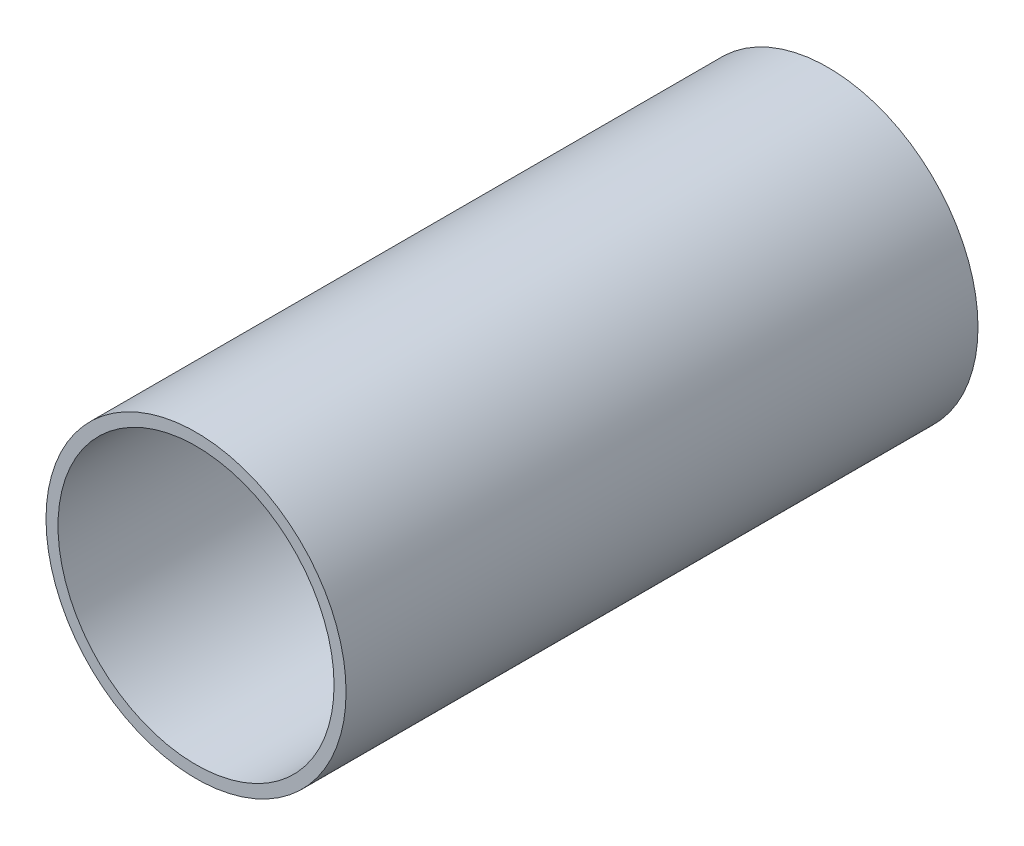
ISO-10303-21;
HEADER;
FILE_DESCRIPTION(('STEP AP214'),'2;1');
FILE_NAME('part.step','',(''),(''),'','','');
FILE_SCHEMA(('AUTOMOTIVE_DESIGN { 1 0 10303 214 1 1 1 1 }'));
ENDSEC;
DATA;
#1=APPLICATION_CONTEXT('core data for automotive mechanical design processes');
#2=APPLICATION_PROTOCOL_DEFINITION('international standard','automotive_design',2000,#1);
#3=PRODUCT_CONTEXT('',#1,'mechanical');
#4=PRODUCT('Part','Part','',(#3));
#5=PRODUCT_RELATED_PRODUCT_CATEGORY('part','',(#4));
#6=PRODUCT_DEFINITION_FORMATION('','',#4);
#7=PRODUCT_DEFINITION_CONTEXT('part definition',#1,'design');
#8=PRODUCT_DEFINITION('design','',#6,#7);
#9=PRODUCT_DEFINITION_SHAPE('','',#8);
#10=(LENGTH_UNIT() NAMED_UNIT(*) SI_UNIT(.MILLI.,.METRE.));
#11=(NAMED_UNIT(*) PLANE_ANGLE_UNIT() SI_UNIT($,.RADIAN.));
#12=(NAMED_UNIT(*) SI_UNIT($,.STERADIAN.) SOLID_ANGLE_UNIT());
#13=UNCERTAINTY_MEASURE_WITH_UNIT(LENGTH_MEASURE(1.E-05),#10,'distance_accuracy_value','');
#14=(GEOMETRIC_REPRESENTATION_CONTEXT(3) GLOBAL_UNCERTAINTY_ASSIGNED_CONTEXT((#13)) GLOBAL_UNIT_ASSIGNED_CONTEXT((#10,
#11,#12)) REPRESENTATION_CONTEXT('',''));
#15=CARTESIAN_POINT('',(0.,0.,0.));
#16=DIRECTION('',(0.,0.,1.));
#17=DIRECTION('',(1.,0.,0.));
#18=AXIS2_PLACEMENT_3D('',#15,#16,#17);
#19=CARTESIAN_POINT('',(0.,0.,-105.3));
#20=DIRECTION('',(0.,0.,1.));
#21=DIRECTION('',(1.,0.,0.));
#22=AXIS2_PLACEMENT_3D('',#19,#20,#21);
#23=CYLINDRICAL_SURFACE('',#22,23.);
#24=CARTESIAN_POINT('',(0.,0.,0.));
#25=DIRECTION('',(0.,0.,1.));
#26=DIRECTION('',(1.,0.,0.));
#27=AXIS2_PLACEMENT_3D('',#24,#25,#26);
#28=CIRCLE('',#27,23.);
#29=CARTESIAN_POINT('',(23.,0.,0.));
#30=VERTEX_POINT('',#29);
#31=EDGE_CURVE('E10',#30,#30,#28,.T.);
#32=ORIENTED_EDGE('',*,*,#31,.T.);
#33=EDGE_LOOP('',(#32));
#34=FACE_BOUND('',#33,.T.);
#35=CARTESIAN_POINT('',(0.,0.,-105.3));
#36=DIRECTION('',(0.,0.,1.));
#37=DIRECTION('',(1.,0.,0.));
#38=AXIS2_PLACEMENT_3D('',#35,#36,#37);
#39=CIRCLE('',#38,23.);
#40=CARTESIAN_POINT('',(23.,0.,-105.3));
#41=VERTEX_POINT('',#40);
#42=EDGE_CURVE('E27',#41,#41,#39,.T.);
#43=ORIENTED_EDGE('',*,*,#42,.F.);
#44=EDGE_LOOP('',(#43));
#45=FACE_BOUND('',#44,.T.);
#46=ADVANCED_FACE('F14',(#34,#45),#23,.F.);
#47=CARTESIAN_POINT('',(0.,0.,-105.3));
#48=DIRECTION('',(0.,0.,1.));
#49=DIRECTION('',(1.,0.,0.));
#50=AXIS2_PLACEMENT_3D('',#47,#48,#49);
#51=CYLINDRICAL_SURFACE('',#50,25.);
#52=CARTESIAN_POINT('',(0.,0.,0.));
#53=DIRECTION('',(0.,0.,1.));
#54=DIRECTION('',(1.,0.,0.));
#55=AXIS2_PLACEMENT_3D('',#52,#53,#54);
#56=CIRCLE('',#55,25.);
#57=CARTESIAN_POINT('',(25.,0.,0.));
#58=VERTEX_POINT('',#57);
#59=EDGE_CURVE('E18',#58,#58,#56,.T.);
#60=ORIENTED_EDGE('',*,*,#59,.F.);
#61=EDGE_LOOP('',(#60));
#62=FACE_BOUND('',#61,.T.);
#63=CARTESIAN_POINT('',(0.,0.,-105.3));
#64=DIRECTION('',(0.,0.,1.));
#65=DIRECTION('',(1.,0.,0.));
#66=AXIS2_PLACEMENT_3D('',#63,#64,#65);
#67=CIRCLE('',#66,25.);
#68=CARTESIAN_POINT('',(25.,0.,-105.3));
#69=VERTEX_POINT('',#68);
#70=EDGE_CURVE('E22',#69,#69,#67,.T.);
#71=ORIENTED_EDGE('',*,*,#70,.T.);
#72=EDGE_LOOP('',(#71));
#73=FACE_BOUND('',#72,.T.);
#74=ADVANCED_FACE('F36',(#62,#73),#51,.T.);
#75=CARTESIAN_POINT('',(0.,0.,-105.3));
#76=DIRECTION('',(0.,0.,1.));
#77=DIRECTION('',(1.,0.,0.));
#78=AXIS2_PLACEMENT_3D('',#75,#76,#77);
#79=PLANE('',#78);
#80=ORIENTED_EDGE('',*,*,#42,.T.);
#81=EDGE_LOOP('',(#80));
#82=FACE_BOUND('',#81,.T.);
#83=ORIENTED_EDGE('',*,*,#70,.F.);
#84=EDGE_LOOP('',(#83));
#85=FACE_BOUND('',#84,.T.);
#86=ADVANCED_FACE('F39',(#82,#85),#79,.F.);
#87=CARTESIAN_POINT('',(0.,0.,0.));
#88=DIRECTION('',(0.,0.,1.));
#89=DIRECTION('',(1.,0.,0.));
#90=AXIS2_PLACEMENT_3D('',#87,#88,#89);
#91=PLANE('',#90);
#92=ORIENTED_EDGE('',*,*,#31,.F.);
#93=EDGE_LOOP('',(#92));
#94=FACE_BOUND('',#93,.T.);
#95=ORIENTED_EDGE('',*,*,#59,.T.);
#96=EDGE_LOOP('',(#95));
#97=FACE_BOUND('',#96,.T.);
#98=ADVANCED_FACE('F16',(#94,#97),#91,.T.);
#99=CLOSED_SHELL('',(#46,#74,#86,#98));
#100=MANIFOLD_SOLID_BREP('B1',#99);
#101=ADVANCED_BREP_SHAPE_REPRESENTATION('',(#18,#100),#14);
#102=SHAPE_DEFINITION_REPRESENTATION(#9,#101);
ENDSEC;
END-ISO-10303-21;
